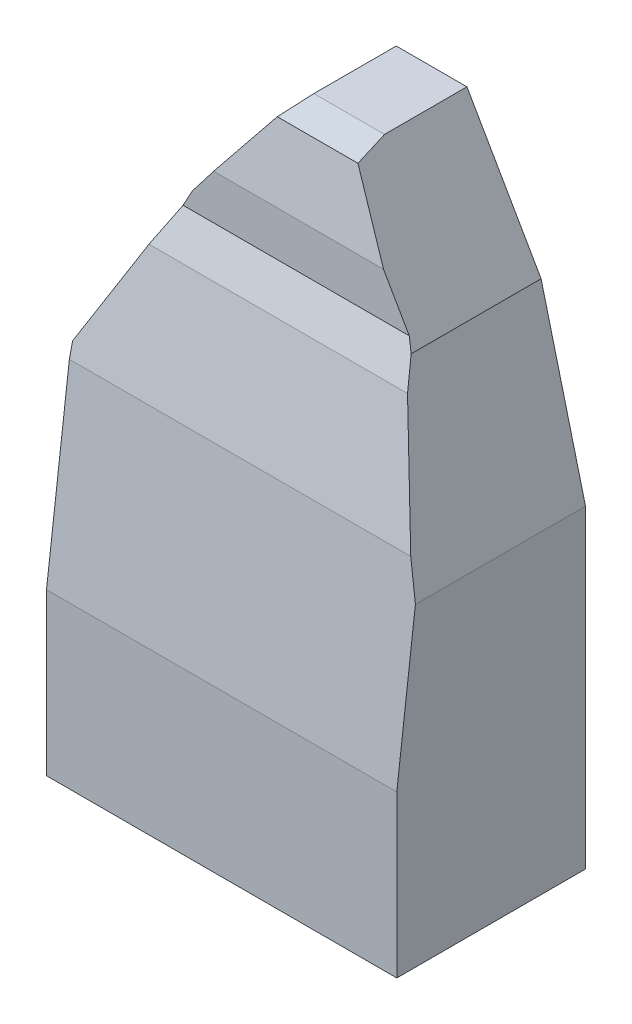
ISO-10303-21;
HEADER;
FILE_DESCRIPTION(('STEP AP214'),'2;1');
FILE_NAME('part.step','',(''),(''),'','','');
FILE_SCHEMA(('AUTOMOTIVE_DESIGN { 1 0 10303 214 1 1 1 1 }'));
ENDSEC;
DATA;
#1=APPLICATION_CONTEXT('core data for automotive mechanical design processes');
#2=APPLICATION_PROTOCOL_DEFINITION('international standard','automotive_design',2000,#1);
#3=PRODUCT_CONTEXT('',#1,'mechanical');
#4=PRODUCT('Part','Part','',(#3));
#5=PRODUCT_RELATED_PRODUCT_CATEGORY('part','',(#4));
#6=PRODUCT_DEFINITION_FORMATION('','',#4);
#7=PRODUCT_DEFINITION_CONTEXT('part definition',#1,'design');
#8=PRODUCT_DEFINITION('design','',#6,#7);
#9=PRODUCT_DEFINITION_SHAPE('','',#8);
#10=(LENGTH_UNIT() NAMED_UNIT(*) SI_UNIT(.MILLI.,.METRE.));
#11=(NAMED_UNIT(*) PLANE_ANGLE_UNIT() SI_UNIT($,.RADIAN.));
#12=(NAMED_UNIT(*) SI_UNIT($,.STERADIAN.) SOLID_ANGLE_UNIT());
#13=UNCERTAINTY_MEASURE_WITH_UNIT(LENGTH_MEASURE(1.E-05),#10,'distance_accuracy_value','');
#14=(GEOMETRIC_REPRESENTATION_CONTEXT(3) GLOBAL_UNCERTAINTY_ASSIGNED_CONTEXT((#13)) GLOBAL_UNIT_ASSIGNED_CONTEXT((#10,
#11,#12)) REPRESENTATION_CONTEXT('',''));
#15=CARTESIAN_POINT('',(0.,0.,0.));
#16=DIRECTION('',(0.,0.,1.));
#17=DIRECTION('',(1.,0.,0.));
#18=AXIS2_PLACEMENT_3D('',#15,#16,#17);
#19=CARTESIAN_POINT('',(431.8,0.,101.6));
#20=DIRECTION('',(-1.,0.,0.));
#21=DIRECTION('',(0.,0.,1.));
#22=AXIS2_PLACEMENT_3D('',#19,#20,#21);
#23=PLANE('',#22);
#24=DIRECTION('',(0.,0.,-1.));
#25=VECTOR('',#24,1.);
#26=CARTESIAN_POINT('',(431.8,387.403361344538,101.6));
#27=LINE('',#26,#25);
#28=CARTESIAN_POINT('',(431.8,387.403361344538,209.68872265246));
#29=VERTEX_POINT('',#28);
#30=CARTESIAN_POINT('',(431.8,387.403361344538,0.));
#31=VERTEX_POINT('',#30);
#32=EDGE_CURVE('E211',#29,#31,#27,.T.);
#33=ORIENTED_EDGE('',*,*,#32,.F.);
#34=DIRECTION('',(0.,-0.99270006358816,0.120609219183544));
#35=VECTOR('',#34,1.);
#36=CARTESIAN_POINT('',(431.8,198.648214009807,232.621743180966));
#37=LINE('',#36,#35);
#38=CARTESIAN_POINT('',(431.8,198.648214009807,232.621743180966));
#39=VERTEX_POINT('',#38);
#40=EDGE_CURVE('E187',#29,#39,#37,.T.);
#41=ORIENTED_EDGE('',*,*,#40,.T.);
#42=DIRECTION('',(0.,-1.,0.));
#43=VECTOR('',#42,1.);
#44=CARTESIAN_POINT('',(431.8,0.,232.621743180966));
#45=LINE('',#44,#43);
#46=CARTESIAN_POINT('',(431.8,0.,232.621743180966));
#47=VERTEX_POINT('',#46);
#48=EDGE_CURVE('E229',#39,#47,#45,.T.);
#49=ORIENTED_EDGE('',*,*,#48,.T.);
#50=DIRECTION('',(0.,0.,-1.));
#51=VECTOR('',#50,1.);
#52=CARTESIAN_POINT('',(431.8,0.,101.6));
#53=LINE('',#52,#51);
#54=CARTESIAN_POINT('',(431.8,0.,0.));
#55=VERTEX_POINT('',#54);
#56=EDGE_CURVE('E182',#47,#55,#53,.T.);
#57=ORIENTED_EDGE('',*,*,#56,.T.);
#58=DIRECTION('',(0.,1.,0.));
#59=VECTOR('',#58,1.);
#60=CARTESIAN_POINT('',(431.8,0.,0.));
#61=LINE('',#60,#59);
#62=EDGE_CURVE('E183',#55,#31,#61,.T.);
#63=ORIENTED_EDGE('',*,*,#62,.T.);
#64=EDGE_LOOP('',(#33,#41,#49,#57,#63));
#65=FACE_BOUND('',#64,.T.);
#66=ADVANCED_FACE('F34',(#65),#23,.F.);
#67=CARTESIAN_POINT('',(431.8,387.403361344538,101.6));
#68=DIRECTION('',(-0.969191073496743,-0.246310095315299,0.));
#69=DIRECTION('',(0.246310095315299,-0.969191073496743,0.));
#70=AXIS2_PLACEMENT_3D('',#67,#68,#69);
#71=PLANE('',#70);
#72=DIRECTION('',(-0.246310095315299,0.969191073496742,0.));
#73=VECTOR('',#72,1.);
#74=CARTESIAN_POINT('',(431.8,387.403361344538,0.));
#75=LINE('',#74,#73);
#76=CARTESIAN_POINT('',(377.065490395893,602.774956457665,0.));
#77=VERTEX_POINT('',#76);
#78=EDGE_CURVE('E186',#31,#77,#75,.T.);
#79=ORIENTED_EDGE('',*,*,#78,.T.);
#80=DIRECTION('',(0.,0.,-1.));
#81=VECTOR('',#80,1.);
#82=CARTESIAN_POINT('',(377.065490395893,602.774956457665,101.6));
#83=LINE('',#82,#81);
#84=CARTESIAN_POINT('',(377.065490395893,602.774956457665,160.184584182668));
#85=VERTEX_POINT('',#84);
#86=EDGE_CURVE('E165',#85,#77,#83,.T.);
#87=ORIENTED_EDGE('',*,*,#86,.F.);
#88=DIRECTION('',(0.230098455850676,-0.905400849081671,0.356796865313197));
#89=VECTOR('',#88,1.);
#90=CARTESIAN_POINT('',(428.592791681923,400.023216282864,240.084205885628));
#91=LINE('',#90,#89);
#92=CARTESIAN_POINT('',(385.188573270177,570.811916530486,172.780455352289));
#93=VERTEX_POINT('',#92);
#94=EDGE_CURVE('E348',#85,#93,#91,.T.);
#95=ORIENTED_EDGE('',*,*,#94,.T.);
#96=DIRECTION('',(0.240618961063724,-0.946797364835967,0.213722402934935));
#97=VECTOR('',#96,1.);
#98=CARTESIAN_POINT('',(466.245274938295,251.866679619812,244.776581417776));
#99=LINE('',#98,#97);
#100=CARTESIAN_POINT('',(420.845747540603,430.506603568072,204.451845392607));
#101=VERTEX_POINT('',#100);
#102=EDGE_CURVE('E48',#93,#101,#99,.T.);
#103=ORIENTED_EDGE('',*,*,#102,.T.);
#104=DIRECTION('',(0.244620012352914,-0.962540865682418,0.116944993256665));
#105=VECTOR('',#104,1.);
#106=CARTESIAN_POINT('',(523.166132699972,27.8921520318276,253.367944436943));
#107=LINE('',#106,#105);
#108=EDGE_CURVE('E41',#101,#29,#107,.T.);
#109=ORIENTED_EDGE('',*,*,#108,.T.);
#110=ORIENTED_EDGE('',*,*,#32,.T.);
#111=EDGE_LOOP('',(#79,#87,#95,#103,#109,#110));
#112=FACE_BOUND('',#111,.T.);
#113=ADVANCED_FACE('F219',(#112),#71,.F.);
#114=CARTESIAN_POINT('',(377.065490395893,602.774956457665,101.6));
#115=DIRECTION('',(-0.867213876975923,-0.497935830785845,0.));
#116=DIRECTION('',(0.497935830785845,-0.867213876975923,0.));
#117=AXIS2_PLACEMENT_3D('',#114,#115,#116);
#118=PLANE('',#117);
#119=DIRECTION('',(-0.497935830785845,0.867213876975922,0.));
#120=VECTOR('',#119,1.);
#121=CARTESIAN_POINT('',(377.065490395893,602.774956457665,0.));
#122=LINE('',#121,#120);
#123=CARTESIAN_POINT('',(285.641844576666,762.,0.));
#124=VERTEX_POINT('',#123);
#125=EDGE_CURVE('E162',#77,#124,#122,.T.);
#126=ORIENTED_EDGE('',*,*,#125,.T.);
#127=DIRECTION('',(0.,0.,-1.));
#128=VECTOR('',#127,1.);
#129=CARTESIAN_POINT('',(285.641844576666,762.,101.6));
#130=LINE('',#129,#128);
#131=CARTESIAN_POINT('',(285.641844576666,762.,101.6));
#132=VERTEX_POINT('',#131);
#133=EDGE_CURVE('E158',#132,#124,#130,.T.);
#134=ORIENTED_EDGE('',*,*,#133,.F.);
#135=DIRECTION('',(0.134036301808538,-0.233440001221541,0.963088799450589));
#136=VECTOR('',#135,1.);
#137=CARTESIAN_POINT('',(307.353125143363,724.187248576504,257.601701429985));
#138=LINE('',#137,#136);
#139=CARTESIAN_POINT('',(290.93153775398,752.787376515822,139.607943988774));
#140=VERTEX_POINT('',#139);
#141=EDGE_CURVE('E145',#132,#140,#138,.T.);
#142=ORIENTED_EDGE('',*,*,#141,.T.);
#143=DIRECTION('',(0.491374157993874,-0.855785951228156,0.16180804224862));
#144=VECTOR('',#143,1.);
#145=CARTESIAN_POINT('',(547.289717156341,306.309423115385,224.025926596711));
#146=LINE('',#145,#144);
#147=CARTESIAN_POINT('',(337.944780780911,670.908278379318,155.089264465625));
#148=VERTEX_POINT('',#147);
#149=EDGE_CURVE('E155',#140,#148,#146,.T.);
#150=ORIENTED_EDGE('',*,*,#149,.T.);
#151=DIRECTION('',(0.497935830785845,-0.867213876975923,0.));
#152=VECTOR('',#151,1.);
#153=CARTESIAN_POINT('',(576.755933198034,254.990538485215,155.089264465625));
#154=LINE('',#153,#152);
#155=CARTESIAN_POINT('',(369.641481781665,615.704741572519,155.089264465625));
#156=VERTEX_POINT('',#155);
#157=EDGE_CURVE('E346',#148,#156,#154,.T.);
#158=ORIENTED_EDGE('',*,*,#157,.T.);
#159=DIRECTION('',(0.47118043852612,-0.82061621113824,0.323385263064741));
#160=VECTOR('',#159,1.);
#161=CARTESIAN_POINT('',(575.15015238372,257.787194840225,296.13602717211));
#162=LINE('',#161,#160);
#163=EDGE_CURVE('E11',#156,#85,#162,.T.);
#164=ORIENTED_EDGE('',*,*,#163,.T.);
#165=ORIENTED_EDGE('',*,*,#86,.T.);
#166=EDGE_LOOP('',(#126,#134,#142,#150,#158,#164,#165));
#167=FACE_BOUND('',#166,.T.);
#168=ADVANCED_FACE('F159',(#167),#118,.F.);
#169=CARTESIAN_POINT('',(285.641844576666,762.,101.6));
#170=DIRECTION('',(0.,-1.,0.));
#171=DIRECTION('',(0.,0.,-1.));
#172=AXIS2_PLACEMENT_3D('',#169,#170,#171);
#173=PLANE('',#172);
#174=DIRECTION('',(-1.,0.,0.));
#175=VECTOR('',#174,1.);
#176=CARTESIAN_POINT('',(285.641844576666,762.,0.));
#177=LINE('',#176,#175);
#178=CARTESIAN_POINT('',(198.504201680673,762.,0.));
#179=VERTEX_POINT('',#178);
#180=EDGE_CURVE('E190',#124,#179,#177,.T.);
#181=ORIENTED_EDGE('',*,*,#180,.T.);
#182=DIRECTION('',(0.,0.,-1.));
#183=VECTOR('',#182,1.);
#184=CARTESIAN_POINT('',(198.504201680673,762.,101.6));
#185=LINE('',#184,#183);
#186=CARTESIAN_POINT('',(198.504201680672,762.,101.6));
#187=VERTEX_POINT('',#186);
#188=EDGE_CURVE('E166',#187,#179,#185,.T.);
#189=ORIENTED_EDGE('',*,*,#188,.F.);
#190=DIRECTION('',(-1.,0.,0.));
#191=VECTOR('',#190,1.);
#192=CARTESIAN_POINT('',(285.641844576666,762.,101.6));
#193=LINE('',#192,#191);
#194=CARTESIAN_POINT('',(198.514140193442,762.,101.6));
#195=VERTEX_POINT('',#194);
#196=EDGE_CURVE('E171',#195,#187,#193,.T.);
#197=ORIENTED_EDGE('',*,*,#196,.F.);
#198=EDGE_CURVE('E150',#132,#195,#193,.T.);
#199=ORIENTED_EDGE('',*,*,#198,.F.);
#200=ORIENTED_EDGE('',*,*,#133,.T.);
#201=EDGE_LOOP('',(#181,#189,#197,#199,#200));
#202=FACE_BOUND('',#201,.T.);
#203=ADVANCED_FACE('F169',(#202),#173,.F.);
#204=CARTESIAN_POINT('',(198.504201680673,762.,101.6));
#205=DIRECTION('',(0.7926239891046,-0.609710760849693,0.));
#206=DIRECTION('',(0.609710760849693,0.7926239891046,0.));
#207=AXIS2_PLACEMENT_3D('',#204,#205,#206);
#208=PLANE('',#207);
#209=DIRECTION('',(-0.609710760849693,-0.7926239891046,0.));
#210=VECTOR('',#209,1.);
#211=CARTESIAN_POINT('',(198.504201680673,762.,0.));
#212=LINE('',#211,#210);
#213=CARTESIAN_POINT('',(102.453781512605,637.134453781513,0.));
#214=VERTEX_POINT('',#213);
#215=EDGE_CURVE('E192',#179,#214,#212,.T.);
#216=ORIENTED_EDGE('',*,*,#215,.T.);
#217=DIRECTION('',(0.,0.,-1.));
#218=VECTOR('',#217,1.);
#219=CARTESIAN_POINT('',(102.453781512605,637.134453781513,101.6));
#220=LINE('',#219,#218);
#221=CARTESIAN_POINT('',(102.453781512605,637.134453781513,101.6));
#222=VERTEX_POINT('',#221);
#223=EDGE_CURVE('E205',#222,#214,#220,.T.);
#224=ORIENTED_EDGE('',*,*,#223,.F.);
#225=DIRECTION('',(-0.609710760849693,-0.7926239891046,0.));
#226=VECTOR('',#225,1.);
#227=CARTESIAN_POINT('',(198.504201680673,762.,101.6));
#228=LINE('',#227,#226);
#229=EDGE_CURVE('E172',#187,#222,#228,.T.);
#230=ORIENTED_EDGE('',*,*,#229,.F.);
#231=ORIENTED_EDGE('',*,*,#188,.T.);
#232=EDGE_LOOP('',(#216,#224,#230,#231));
#233=FACE_BOUND('',#232,.T.);
#234=ADVANCED_FACE('F279',(#233),#208,.F.);
#235=CARTESIAN_POINT('',(102.453781512605,637.134453781513,101.6));
#236=DIRECTION('',(0.879031855696728,-0.476763040377887,0.));
#237=DIRECTION('',(0.476763040377887,0.879031855696728,0.));
#238=AXIS2_PLACEMENT_3D('',#235,#236,#237);
#239=PLANE('',#238);
#240=DIRECTION('',(-0.476763040377887,-0.879031855696728,0.));
#241=VECTOR('',#240,1.);
#242=CARTESIAN_POINT('',(102.453781512605,637.134453781513,0.));
#243=LINE('',#242,#241);
#244=CARTESIAN_POINT('',(0.,448.235294117647,0.));
#245=VERTEX_POINT('',#244);
#246=EDGE_CURVE('E194',#214,#245,#243,.T.);
#247=ORIENTED_EDGE('',*,*,#246,.T.);
#248=DIRECTION('',(0.,0.,-1.));
#249=VECTOR('',#248,1.);
#250=CARTESIAN_POINT('',(0.,448.235294117647,101.6));
#251=LINE('',#250,#249);
#252=CARTESIAN_POINT('',(0.,448.235294117647,200.449913737673));
#253=VERTEX_POINT('',#252);
#254=EDGE_CURVE('E56',#253,#245,#251,.T.);
#255=ORIENTED_EDGE('',*,*,#254,.F.);
#256=DIRECTION('',(0.467645680255062,0.862221722970269,-0.194630979489293));
#257=VECTOR('',#256,1.);
#258=CARTESIAN_POINT('',(256.007835886735,920.249741533814,93.9011783181716));
#259=LINE('',#258,#257);
#260=CARTESIAN_POINT('',(66.4822358849298,570.811916530486,172.780455352289));
#261=VERTEX_POINT('',#260);
#262=EDGE_CURVE('E214',#253,#261,#259,.T.);
#263=ORIENTED_EDGE('',*,*,#262,.T.);
#264=DIRECTION('',(0.450499381355594,0.830608234374376,-0.327322880941294));
#265=VECTOR('',#264,1.);
#266=CARTESIAN_POINT('',(297.540451370432,996.825501331881,4.89866929902194));
#267=LINE('',#266,#265);
#268=CARTESIAN_POINT('',(90.830886755185,615.704741572519,155.089264465625));
#269=VERTEX_POINT('',#268);
#270=EDGE_CURVE('E337',#261,#269,#267,.T.);
#271=ORIENTED_EDGE('',*,*,#270,.T.);
#272=DIRECTION('',(0.476763040377887,0.879031855696728,0.));
#273=VECTOR('',#272,1.);
#274=CARTESIAN_POINT('',(344.080816470128,1082.63429948445,155.089264465625));
#275=LINE('',#274,#273);
#276=CARTESIAN_POINT('',(102.079559314268,636.444481603329,155.089264465625));
#277=VERTEX_POINT('',#276);
#278=EDGE_CURVE('E336',#269,#277,#275,.T.);
#279=ORIENTED_EDGE('',*,*,#278,.T.);
#280=DIRECTION('',(0.,0.,-1.));
#281=VECTOR('',#280,1.);
#282=CARTESIAN_POINT('',(102.079559314268,636.444481603329,232.621743180966));
#283=LINE('',#282,#281);
#284=CARTESIAN_POINT('',(102.079559314268,636.444481603329,101.6));
#285=VERTEX_POINT('',#284);
#286=EDGE_CURVE('E330',#277,#285,#283,.T.);
#287=ORIENTED_EDGE('',*,*,#286,.T.);
#288=DIRECTION('',(-0.476763040377887,-0.879031855696728,0.));
#289=VECTOR('',#288,1.);
#290=CARTESIAN_POINT('',(102.453781512605,637.134453781513,101.6));
#291=LINE('',#290,#289);
#292=EDGE_CURVE('E174',#222,#285,#291,.T.);
#293=ORIENTED_EDGE('',*,*,#292,.F.);
#294=ORIENTED_EDGE('',*,*,#223,.T.);
#295=EDGE_LOOP('',(#247,#255,#263,#271,#279,#287,#293,#294));
#296=FACE_BOUND('',#295,.T.);
#297=ADVANCED_FACE('F282',(#296),#239,.F.);
#298=CARTESIAN_POINT('',(0.,448.235294117647,101.6));
#299=DIRECTION('',(1.,0.,0.));
#300=DIRECTION('',(0.,0.,-1.));
#301=AXIS2_PLACEMENT_3D('',#298,#299,#300);
#302=PLANE('',#301);
#303=DIRECTION('',(0.,0.975456616301023,-0.220191711275785));
#304=VECTOR('',#303,1.);
#305=CARTESIAN_POINT('',(0.,430.506603568072,204.451845392607));
#306=LINE('',#305,#304);
#307=CARTESIAN_POINT('',(0.,430.506603568072,204.451845392607));
#308=VERTEX_POINT('',#307);
#309=EDGE_CURVE('E241',#308,#253,#306,.T.);
#310=ORIENTED_EDGE('',*,*,#309,.T.);
#311=ORIENTED_EDGE('',*,*,#254,.T.);
#312=DIRECTION('',(0.,-1.,0.));
#313=VECTOR('',#312,1.);
#314=CARTESIAN_POINT('',(0.,448.235294117647,0.));
#315=LINE('',#314,#313);
#316=CARTESIAN_POINT('',(0.,0.,0.));
#317=VERTEX_POINT('',#316);
#318=EDGE_CURVE('E196',#245,#317,#315,.T.);
#319=ORIENTED_EDGE('',*,*,#318,.T.);
#320=DIRECTION('',(0.,0.,-1.));
#321=VECTOR('',#320,1.);
#322=CARTESIAN_POINT('',(0.,0.,101.6));
#323=LINE('',#322,#321);
#324=CARTESIAN_POINT('',(0.,0.,232.621743180966));
#325=VERTEX_POINT('',#324);
#326=EDGE_CURVE('E201',#325,#317,#323,.T.);
#327=ORIENTED_EDGE('',*,*,#326,.F.);
#328=DIRECTION('',(0.,1.,0.));
#329=VECTOR('',#328,1.);
#330=CARTESIAN_POINT('',(0.,0.,232.621743180966));
#331=LINE('',#330,#329);
#332=CARTESIAN_POINT('',(0.,198.648214009807,232.621743180966));
#333=VERTEX_POINT('',#332);
#334=EDGE_CURVE('E234',#325,#333,#331,.T.);
#335=ORIENTED_EDGE('',*,*,#334,.T.);
#336=DIRECTION('',(0.,0.992700063588159,-0.120609219183544));
#337=VECTOR('',#336,1.);
#338=CARTESIAN_POINT('',(0.,198.648214009807,232.621743180966));
#339=LINE('',#338,#337);
#340=EDGE_CURVE('E237',#333,#308,#339,.T.);
#341=ORIENTED_EDGE('',*,*,#340,.T.);
#342=EDGE_LOOP('',(#310,#311,#319,#327,#335,#341));
#343=FACE_BOUND('',#342,.T.);
#344=ADVANCED_FACE('F261',(#343),#302,.F.);
#345=CARTESIAN_POINT('',(0.,0.,101.6));
#346=DIRECTION('',(0.,1.,0.));
#347=DIRECTION('',(0.,0.,1.));
#348=AXIS2_PLACEMENT_3D('',#345,#346,#347);
#349=PLANE('',#348);
#350=DIRECTION('',(1.,0.,0.));
#351=VECTOR('',#350,1.);
#352=CARTESIAN_POINT('',(0.,0.,0.));
#353=LINE('',#352,#351);
#354=EDGE_CURVE('E176',#317,#55,#353,.T.);
#355=ORIENTED_EDGE('',*,*,#354,.T.);
#356=ORIENTED_EDGE('',*,*,#56,.F.);
#357=DIRECTION('',(-1.,0.,0.));
#358=VECTOR('',#357,1.);
#359=CARTESIAN_POINT('',(1204.98218887024,0.,232.621743180966));
#360=LINE('',#359,#358);
#361=EDGE_CURVE('E178',#47,#325,#360,.T.);
#362=ORIENTED_EDGE('',*,*,#361,.T.);
#363=ORIENTED_EDGE('',*,*,#326,.T.);
#364=EDGE_LOOP('',(#355,#356,#362,#363));
#365=FACE_BOUND('',#364,.T.);
#366=ADVANCED_FACE('F257',(#365),#349,.F.);
#367=CARTESIAN_POINT('',(0.,0.,0.));
#368=DIRECTION('',(0.,0.,1.));
#369=DIRECTION('',(1.,0.,0.));
#370=AXIS2_PLACEMENT_3D('',#367,#368,#369);
#371=PLANE('',#370);
#372=ORIENTED_EDGE('',*,*,#62,.F.);
#373=ORIENTED_EDGE('',*,*,#354,.F.);
#374=ORIENTED_EDGE('',*,*,#318,.F.);
#375=ORIENTED_EDGE('',*,*,#246,.F.);
#376=ORIENTED_EDGE('',*,*,#215,.F.);
#377=ORIENTED_EDGE('',*,*,#180,.F.);
#378=ORIENTED_EDGE('',*,*,#125,.F.);
#379=ORIENTED_EDGE('',*,*,#78,.F.);
#380=EDGE_LOOP('',(#372,#373,#374,#375,#376,#377,#378,#379));
#381=FACE_BOUND('',#380,.T.);
#382=ADVANCED_FACE('F266',(#381),#371,.F.);
#383=CARTESIAN_POINT('',(1204.98218887024,752.787376515822,139.607943988774));
#384=DIRECTION('',(0.,0.971858439473431,0.235565646103729));
#385=DIRECTION('',(0.,-0.235565646103729,0.971858439473431));
#386=AXIS2_PLACEMENT_3D('',#383,#384,#385);
#387=PLANE('',#386);
#388=ORIENTED_EDGE('',*,*,#141,.F.);
#389=ORIENTED_EDGE('',*,*,#198,.T.);
#390=DIRECTION('',(0.178038698581419,0.231802128357528,-0.956331529908093));
#391=VECTOR('',#390,1.);
#392=CARTESIAN_POINT('',(223.565353123708,794.616080219873,-32.96212036227));
#393=LINE('',#392,#391);
#394=CARTESIAN_POINT('',(191.438262559075,752.787376515822,139.607943988774));
#395=VERTEX_POINT('',#394);
#396=EDGE_CURVE('E238',#395,#195,#393,.T.);
#397=ORIENTED_EDGE('',*,*,#396,.F.);
#398=DIRECTION('',(-1.,0.,0.));
#399=VECTOR('',#398,1.);
#400=CARTESIAN_POINT('',(1204.98218887024,752.787376515822,139.607943988774));
#401=LINE('',#400,#399);
#402=EDGE_CURVE('E151',#140,#395,#401,.T.);
#403=ORIENTED_EDGE('',*,*,#402,.F.);
#404=EDGE_LOOP('',(#388,#389,#397,#403));
#405=FACE_BOUND('',#404,.T.);
#406=ADVANCED_FACE('F147',(#405),#387,.T.);
#407=CARTESIAN_POINT('',(1204.98218887024,670.908278379318,155.089264465625));
#408=DIRECTION('',(0.,0.185783690480533,0.982590667751039));
#409=DIRECTION('',(0.,-0.982590667751039,0.185783690480533));
#410=AXIS2_PLACEMENT_3D('',#407,#408,#409);
#411=PLANE('',#410);
#412=ORIENTED_EDGE('',*,*,#149,.F.);
#413=ORIENTED_EDGE('',*,*,#402,.T.);
#414=DIRECTION('',(0.602394096410472,0.784302709301712,-0.148292322093244));
#415=VECTOR('',#414,1.);
#416=CARTESIAN_POINT('',(519.164215576894,1179.47873088331,58.9311198418813));
#417=LINE('',#416,#415);
#418=CARTESIAN_POINT('',(128.549935447776,670.908278379318,155.089264465625));
#419=VERTEX_POINT('',#418);
#420=EDGE_CURVE('E342',#419,#395,#417,.T.);
#421=ORIENTED_EDGE('',*,*,#420,.F.);
#422=DIRECTION('',(-1.,0.,0.));
#423=VECTOR('',#422,1.);
#424=CARTESIAN_POINT('',(1204.98218887024,670.908278379318,155.089264465625));
#425=LINE('',#424,#423);
#426=EDGE_CURVE('E245',#148,#419,#425,.T.);
#427=ORIENTED_EDGE('',*,*,#426,.F.);
#428=EDGE_LOOP('',(#412,#413,#421,#427));
#429=FACE_BOUND('',#428,.T.);
#430=ADVANCED_FACE('F308',(#429),#411,.T.);
#431=CARTESIAN_POINT('',(1204.98218887024,615.704741572519,155.089264465625));
#432=DIRECTION('',(0.,0.,1.));
#433=DIRECTION('',(1.,0.,0.));
#434=AXIS2_PLACEMENT_3D('',#431,#432,#433);
#435=PLANE('',#434);
#436=ORIENTED_EDGE('',*,*,#157,.F.);
#437=ORIENTED_EDGE('',*,*,#426,.T.);
#438=DIRECTION('',(0.609128886515623,0.793071244978809,0.));
#439=VECTOR('',#438,1.);
#440=CARTESIAN_POINT('',(501.279337978843,1156.19304790722,155.089264465625));
#441=LINE('',#440,#439);
#442=EDGE_CURVE('E216',#277,#419,#441,.T.);
#443=ORIENTED_EDGE('',*,*,#442,.F.);
#444=ORIENTED_EDGE('',*,*,#278,.F.);
#445=DIRECTION('',(-1.,0.,0.));
#446=VECTOR('',#445,1.);
#447=CARTESIAN_POINT('',(1204.98218887024,615.704741572519,155.089264465625));
#448=LINE('',#447,#446);
#449=EDGE_CURVE('E247',#156,#269,#448,.T.);
#450=ORIENTED_EDGE('',*,*,#449,.F.);
#451=EDGE_LOOP('',(#436,#437,#443,#444,#450));
#452=FACE_BOUND('',#451,.T.);
#453=ADVANCED_FACE('F304',(#452),#435,.T.);
#454=CARTESIAN_POINT('',(1204.98218887024,570.811916530486,172.780455352289));
#455=DIRECTION('',(0.,0.366634642563736,0.930365003034917));
#456=DIRECTION('',(0.,-0.930365003034917,0.366634642563736));
#457=AXIS2_PLACEMENT_3D('',#454,#455,#456);
#458=PLANE('',#457);
#459=ORIENTED_EDGE('',*,*,#163,.F.);
#460=ORIENTED_EDGE('',*,*,#449,.T.);
#461=ORIENTED_EDGE('',*,*,#270,.F.);
#462=DIRECTION('',(-1.,0.,0.));
#463=VECTOR('',#462,1.);
#464=CARTESIAN_POINT('',(1204.98218887024,570.811916530486,172.780455352289));
#465=LINE('',#464,#463);
#466=EDGE_CURVE('E249',#93,#261,#465,.T.);
#467=ORIENTED_EDGE('',*,*,#466,.F.);
#468=ORIENTED_EDGE('',*,*,#94,.F.);
#469=EDGE_LOOP('',(#459,#460,#461,#467,#468));
#470=FACE_BOUND('',#469,.T.);
#471=ADVANCED_FACE('F300',(#470),#458,.T.);
#472=CARTESIAN_POINT('',(1204.98218887024,430.506603568072,204.451845392607));
#473=DIRECTION('',(0.,0.220191711275785,0.975456616301023));
#474=DIRECTION('',(0.,-0.975456616301023,0.220191711275785));
#475=AXIS2_PLACEMENT_3D('',#472,#473,#474);
#476=PLANE('',#475);
#477=ORIENTED_EDGE('',*,*,#102,.F.);
#478=ORIENTED_EDGE('',*,*,#466,.T.);
#479=ORIENTED_EDGE('',*,*,#262,.F.);
#480=ORIENTED_EDGE('',*,*,#309,.F.);
#481=DIRECTION('',(-1.,0.,0.));
#482=VECTOR('',#481,1.);
#483=CARTESIAN_POINT('',(1204.98218887024,430.506603568072,204.451845392607));
#484=LINE('',#483,#482);
#485=EDGE_CURVE('E251',#101,#308,#484,.T.);
#486=ORIENTED_EDGE('',*,*,#485,.F.);
#487=EDGE_LOOP('',(#477,#478,#479,#480,#486));
#488=FACE_BOUND('',#487,.T.);
#489=ADVANCED_FACE('F297',(#488),#476,.T.);
#490=CARTESIAN_POINT('',(1204.98218887024,198.648214009807,232.621743180966));
#491=DIRECTION('',(0.,0.120609219183544,0.992700063588159));
#492=DIRECTION('',(0.,-0.99270006358816,0.120609219183544));
#493=AXIS2_PLACEMENT_3D('',#490,#491,#492);
#494=PLANE('',#493);
#495=ORIENTED_EDGE('',*,*,#108,.F.);
#496=ORIENTED_EDGE('',*,*,#485,.T.);
#497=ORIENTED_EDGE('',*,*,#340,.F.);
#498=DIRECTION('',(-1.,0.,0.));
#499=VECTOR('',#498,1.);
#500=CARTESIAN_POINT('',(1204.98218887024,198.648214009807,232.621743180966));
#501=LINE('',#500,#499);
#502=EDGE_CURVE('E225',#39,#333,#501,.T.);
#503=ORIENTED_EDGE('',*,*,#502,.F.);
#504=ORIENTED_EDGE('',*,*,#40,.F.);
#505=EDGE_LOOP('',(#495,#496,#497,#503,#504));
#506=FACE_BOUND('',#505,.T.);
#507=ADVANCED_FACE('F223',(#506),#494,.T.);
#508=CARTESIAN_POINT('',(1204.98218887024,0.,232.621743180966));
#509=DIRECTION('',(0.,0.,1.));
#510=DIRECTION('',(1.,0.,0.));
#511=AXIS2_PLACEMENT_3D('',#508,#509,#510);
#512=PLANE('',#511);
#513=ORIENTED_EDGE('',*,*,#48,.F.);
#514=ORIENTED_EDGE('',*,*,#502,.T.);
#515=ORIENTED_EDGE('',*,*,#334,.F.);
#516=ORIENTED_EDGE('',*,*,#361,.F.);
#517=EDGE_LOOP('',(#513,#514,#515,#516));
#518=FACE_BOUND('',#517,.T.);
#519=ADVANCED_FACE('F259',(#518),#512,.T.);
#520=CARTESIAN_POINT('',(0.,0.,101.6));
#521=DIRECTION('',(0.,0.,1.));
#522=DIRECTION('',(0.,-1.,0.));
#523=AXIS2_PLACEMENT_3D('',#520,#521,#522);
#524=PLANE('',#523);
#525=ORIENTED_EDGE('',*,*,#292,.T.);
#526=DIRECTION('',(-0.609128886515623,-0.793071244978809,0.));
#527=VECTOR('',#526,1.);
#528=CARTESIAN_POINT('',(102.079559314268,636.444481603329,101.6));
#529=LINE('',#528,#527);
#530=EDGE_CURVE('E154',#195,#285,#529,.T.);
#531=ORIENTED_EDGE('',*,*,#530,.F.);
#532=ORIENTED_EDGE('',*,*,#196,.T.);
#533=ORIENTED_EDGE('',*,*,#229,.T.);
#534=EDGE_LOOP('',(#525,#531,#532,#533));
#535=FACE_BOUND('',#534,.T.);
#536=ADVANCED_FACE('F294',(#535),#524,.T.);
#537=CARTESIAN_POINT('',(102.079559314268,636.444481603329,232.621743180966));
#538=DIRECTION('',(0.793071244978809,-0.609128886515623,0.));
#539=DIRECTION('',(0.609128886515623,0.793071244978809,0.));
#540=AXIS2_PLACEMENT_3D('',#537,#538,#539);
#541=PLANE('',#540);
#542=ORIENTED_EDGE('',*,*,#396,.T.);
#543=ORIENTED_EDGE('',*,*,#530,.T.);
#544=ORIENTED_EDGE('',*,*,#286,.F.);
#545=ORIENTED_EDGE('',*,*,#442,.T.);
#546=ORIENTED_EDGE('',*,*,#420,.T.);
#547=EDGE_LOOP('',(#542,#543,#544,#545,#546));
#548=FACE_BOUND('',#547,.T.);
#549=ADVANCED_FACE('F315',(#548),#541,.F.);
#550=CLOSED_SHELL('',(#66,#113,#168,#203,#234,#297,#344,#366,#382,#406,#430,#453,#471,#489,#507,
#519,#536,#549));
#551=MANIFOLD_SOLID_BREP('B2',#550);
#552=ADVANCED_BREP_SHAPE_REPRESENTATION('',(#18,#551),#14);
#553=SHAPE_DEFINITION_REPRESENTATION(#9,#552);
ENDSEC;
END-ISO-10303-21;
